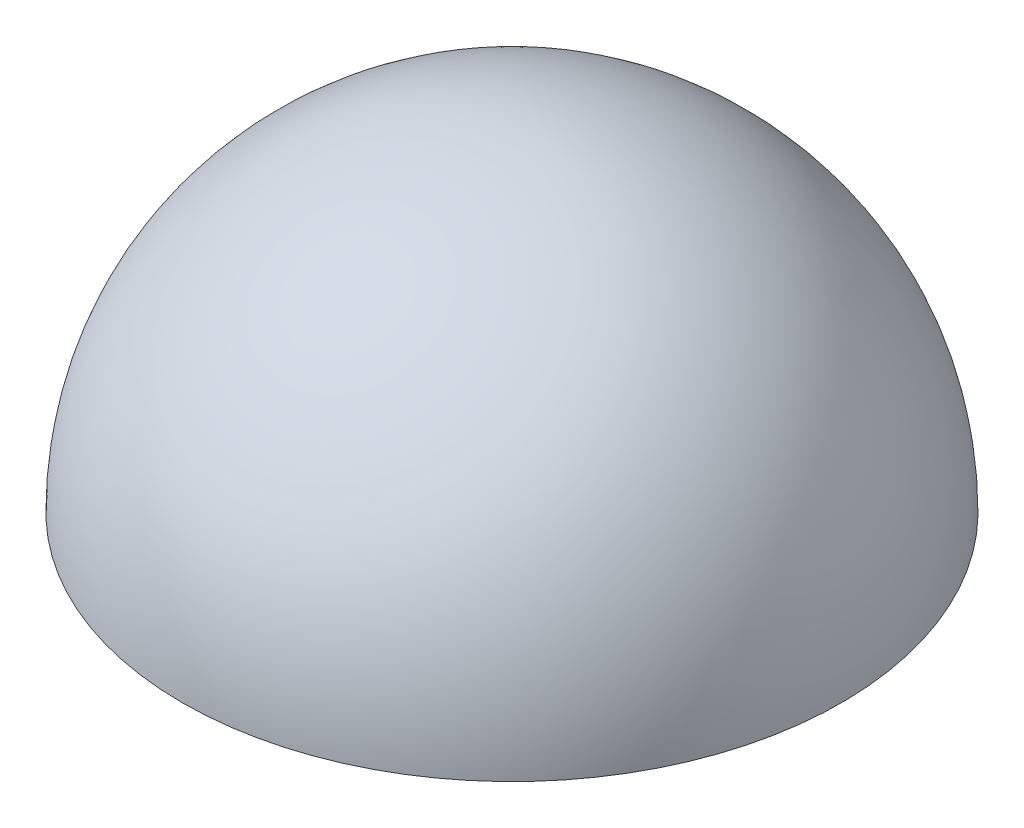
ISO-10303-21;
HEADER;
FILE_DESCRIPTION(('STEP AP214'),'2;1');
FILE_NAME('part.step','',(''),(''),'','','');
FILE_SCHEMA(('AUTOMOTIVE_DESIGN { 1 0 10303 214 1 1 1 1 }'));
ENDSEC;
DATA;
#1=APPLICATION_CONTEXT('core data for automotive mechanical design processes');
#2=APPLICATION_PROTOCOL_DEFINITION('international standard','automotive_design',2000,#1);
#3=PRODUCT_CONTEXT('',#1,'mechanical');
#4=PRODUCT('Part','Part','',(#3));
#5=PRODUCT_RELATED_PRODUCT_CATEGORY('part','',(#4));
#6=PRODUCT_DEFINITION_FORMATION('','',#4);
#7=PRODUCT_DEFINITION_CONTEXT('part definition',#1,'design');
#8=PRODUCT_DEFINITION('design','',#6,#7);
#9=PRODUCT_DEFINITION_SHAPE('','',#8);
#10=(LENGTH_UNIT() NAMED_UNIT(*) SI_UNIT(.MILLI.,.METRE.));
#11=(NAMED_UNIT(*) PLANE_ANGLE_UNIT() SI_UNIT($,.RADIAN.));
#12=(NAMED_UNIT(*) SI_UNIT($,.STERADIAN.) SOLID_ANGLE_UNIT());
#13=UNCERTAINTY_MEASURE_WITH_UNIT(LENGTH_MEASURE(1.E-05),#10,'distance_accuracy_value','');
#14=(GEOMETRIC_REPRESENTATION_CONTEXT(3) GLOBAL_UNCERTAINTY_ASSIGNED_CONTEXT((#13)) GLOBAL_UNIT_ASSIGNED_CONTEXT((#10,
#11,#12)) REPRESENTATION_CONTEXT('',''));
#15=CARTESIAN_POINT('',(0.,0.,0.));
#16=DIRECTION('',(0.,0.,1.));
#17=DIRECTION('',(1.,0.,0.));
#18=AXIS2_PLACEMENT_3D('',#15,#16,#17);
#19=CARTESIAN_POINT('',(0.,0.,-25.));
#20=DIRECTION('',(0.,0.,-1.));
#21=DIRECTION('',(-1.,0.,0.));
#22=AXIS2_PLACEMENT_3D('',#19,#20,#21);
#23=SPHERICAL_SURFACE('',#22,25.);
#24=CARTESIAN_POINT('',(0.,0.,-25.));
#25=DIRECTION('',(0.,-1.,0.));
#26=DIRECTION('',(0.,0.,1.));
#27=AXIS2_PLACEMENT_3D('',#24,#25,#26);
#28=SPHERICAL_SURFACE('',#27,25.);
#29=CARTESIAN_POINT('',(0.,0.,-25.));
#30=DIRECTION('',(0.,-1.,0.));
#31=DIRECTION('',(0.,0.,1.));
#32=AXIS2_PLACEMENT_3D('',#29,#30,#31);
#33=CIRCLE('',#32,25.);
#34=CARTESIAN_POINT('',(0.,0.,0.));
#35=VERTEX_POINT('',#34);
#36=EDGE_CURVE('E10',#35,#35,#33,.T.);
#37=ORIENTED_EDGE('',*,*,#36,.F.);
#38=EDGE_LOOP('',(#37));
#39=FACE_BOUND('',#38,.T.);
#40=ADVANCED_FACE('F41',(#39),#28,.T.);
#41=CARTESIAN_POINT('',(0.,0.,-25.));
#42=DIRECTION('',(0.,-1.,0.));
#43=DIRECTION('',(0.,0.,1.));
#44=AXIS2_PLACEMENT_3D('',#41,#42,#43);
#45=PLANE('',#44);
#46=ORIENTED_EDGE('',*,*,#36,.T.);
#47=EDGE_LOOP('',(#46));
#48=FACE_BOUND('',#47,.T.);
#49=ADVANCED_FACE('F48',(#48),#45,.T.);
#50=CLOSED_SHELL('',(#40,#49));
#51=MANIFOLD_SOLID_BREP('B2',#50);
#52=ADVANCED_BREP_SHAPE_REPRESENTATION('',(#18,#51),#14);
#53=SHAPE_DEFINITION_REPRESENTATION(#9,#52);
ENDSEC;
END-ISO-10303-21;
